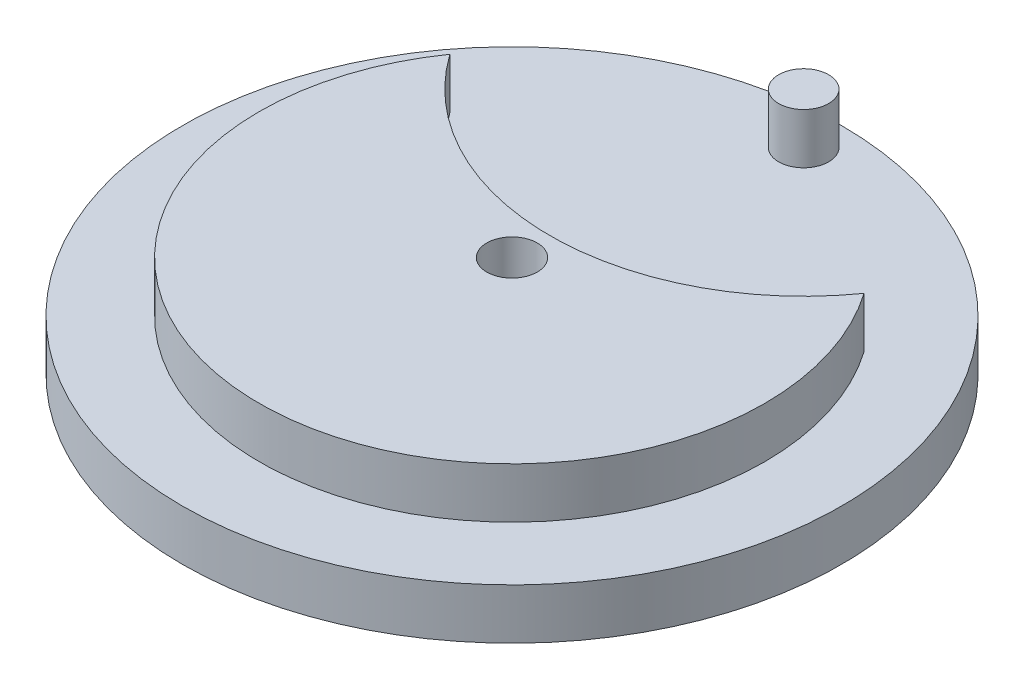
ISO-10303-21;
HEADER;
FILE_DESCRIPTION(('STEP AP214'),'2;1');
FILE_NAME('part.step','',(''),(''),'','','');
FILE_SCHEMA(('AUTOMOTIVE_DESIGN { 1 0 10303 214 1 1 1 1 }'));
ENDSEC;
DATA;
#1=APPLICATION_CONTEXT('core data for automotive mechanical design processes');
#2=APPLICATION_PROTOCOL_DEFINITION('international standard','automotive_design',2000,#1);
#3=PRODUCT_CONTEXT('',#1,'mechanical');
#4=PRODUCT('Part','Part','',(#3));
#5=PRODUCT_RELATED_PRODUCT_CATEGORY('part','',(#4));
#6=PRODUCT_DEFINITION_FORMATION('','',#4);
#7=PRODUCT_DEFINITION_CONTEXT('part definition',#1,'design');
#8=PRODUCT_DEFINITION('design','',#6,#7);
#9=PRODUCT_DEFINITION_SHAPE('','',#8);
#10=(LENGTH_UNIT() NAMED_UNIT(*) SI_UNIT(.MILLI.,.METRE.));
#11=(NAMED_UNIT(*) PLANE_ANGLE_UNIT() SI_UNIT($,.RADIAN.));
#12=(NAMED_UNIT(*) SI_UNIT($,.STERADIAN.) SOLID_ANGLE_UNIT());
#13=UNCERTAINTY_MEASURE_WITH_UNIT(LENGTH_MEASURE(1.E-05),#10,'distance_accuracy_value','');
#14=(GEOMETRIC_REPRESENTATION_CONTEXT(3) GLOBAL_UNCERTAINTY_ASSIGNED_CONTEXT((#13)) GLOBAL_UNIT_ASSIGNED_CONTEXT((#10,
#11,#12)) REPRESENTATION_CONTEXT('',''));
#15=CARTESIAN_POINT('',(0.,0.,0.));
#16=DIRECTION('',(0.,0.,1.));
#17=DIRECTION('',(1.,0.,0.));
#18=AXIS2_PLACEMENT_3D('',#15,#16,#17);
#19=CARTESIAN_POINT('',(0.,10.,0.));
#20=DIRECTION('',(0.,-1.,0.));
#21=DIRECTION('',(0.,0.,-1.));
#22=AXIS2_PLACEMENT_3D('',#19,#20,#21);
#23=CYLINDRICAL_SURFACE('',#22,65.2350269189626);
#24=CARTESIAN_POINT('',(0.,10.,0.));
#25=DIRECTION('',(0.,1.,0.));
#26=DIRECTION('',(0.,0.,1.));
#27=AXIS2_PLACEMENT_3D('',#24,#25,#26);
#28=CIRCLE('',#27,65.2350269189626);
#29=CARTESIAN_POINT('',(0.,10.,65.2350269189626));
#30=VERTEX_POINT('',#29);
#31=EDGE_CURVE('E87',#30,#30,#28,.T.);
#32=ORIENTED_EDGE('',*,*,#31,.F.);
#33=EDGE_LOOP('',(#32));
#34=FACE_BOUND('',#33,.T.);
#35=CARTESIAN_POINT('',(0.,0.,0.));
#36=DIRECTION('',(0.,1.,0.));
#37=DIRECTION('',(0.,0.,1.));
#38=AXIS2_PLACEMENT_3D('',#35,#36,#37);
#39=CIRCLE('',#38,65.2350269189626);
#40=CARTESIAN_POINT('',(0.,0.,65.2350269189626));
#41=VERTEX_POINT('',#40);
#42=EDGE_CURVE('E38',#41,#41,#39,.T.);
#43=ORIENTED_EDGE('',*,*,#42,.T.);
#44=EDGE_LOOP('',(#43));
#45=FACE_BOUND('',#44,.T.);
#46=ADVANCED_FACE('F35',(#34,#45),#23,.T.);
#47=CARTESIAN_POINT('',(0.,10.,0.));
#48=DIRECTION('',(0.,1.,0.));
#49=DIRECTION('',(0.,0.,1.));
#50=AXIS2_PLACEMENT_3D('',#47,#48,#49);
#51=PLANE('',#50);
#52=CARTESIAN_POINT('',(0.,10.,-57.7350269189626));
#53=DIRECTION('',(0.,1.,0.));
#54=DIRECTION('',(0.,0.,1.));
#55=AXIS2_PLACEMENT_3D('',#52,#53,#54);
#56=CIRCLE('',#55,4.95);
#57=CARTESIAN_POINT('',(0.,10.,-52.7850269189626));
#58=VERTEX_POINT('',#57);
#59=EDGE_CURVE('E84',#58,#58,#56,.T.);
#60=ORIENTED_EDGE('',*,*,#59,.F.);
#61=EDGE_LOOP('',(#60));
#62=FACE_BOUND('',#61,.T.);
#63=ORIENTED_EDGE('',*,*,#31,.T.);
#64=EDGE_LOOP('',(#63));
#65=FACE_BOUND('',#64,.T.);
#66=CARTESIAN_POINT('',(0.,10.,0.));
#67=DIRECTION('',(0.,1.,0.));
#68=DIRECTION('',(0.,0.,1.));
#69=AXIS2_PLACEMENT_3D('',#66,#67,#68);
#70=CIRCLE('',#69,50.0338358093371);
#71=CARTESIAN_POINT('',(-40.9891140728577,10.,-28.6928083902215));
#72=VERTEX_POINT('',#71);
#73=CARTESIAN_POINT('',(40.9891140728577,10.,-28.6928083902214));
#74=VERTEX_POINT('',#73);
#75=EDGE_CURVE('E43',#72,#74,#70,.T.);
#76=ORIENTED_EDGE('',*,*,#75,.F.);
#77=CARTESIAN_POINT('',(0.,10.,-57.7350269189626));
#78=DIRECTION('',(0.,1.,0.));
#79=DIRECTION('',(0.,0.,1.));
#80=AXIS2_PLACEMENT_3D('',#77,#78,#79);
#81=CIRCLE('',#80,50.2350269189626);
#82=EDGE_CURVE('E11',#72,#74,#81,.T.);
#83=ORIENTED_EDGE('',*,*,#82,.T.);
#84=EDGE_LOOP('',(#76,#83));
#85=FACE_BOUND('',#84,.T.);
#86=ADVANCED_FACE('F92',(#62,#65,#85),#51,.T.);
#87=CARTESIAN_POINT('',(0.,0.,0.));
#88=DIRECTION('',(0.,1.,0.));
#89=DIRECTION('',(0.,0.,1.));
#90=AXIS2_PLACEMENT_3D('',#87,#88,#89);
#91=PLANE('',#90);
#92=ORIENTED_EDGE('',*,*,#42,.F.);
#93=EDGE_LOOP('',(#92));
#94=FACE_BOUND('',#93,.T.);
#95=CARTESIAN_POINT('',(0.,0.,0.));
#96=DIRECTION('',(0.,1.,0.));
#97=DIRECTION('',(0.,0.,1.));
#98=AXIS2_PLACEMENT_3D('',#95,#96,#97);
#99=CIRCLE('',#98,5.);
#100=CARTESIAN_POINT('',(0.,0.,5.));
#101=VERTEX_POINT('',#100);
#102=EDGE_CURVE('E76',#101,#101,#99,.T.);
#103=ORIENTED_EDGE('',*,*,#102,.T.);
#104=EDGE_LOOP('',(#103));
#105=FACE_BOUND('',#104,.T.);
#106=ADVANCED_FACE('F99',(#94,#105),#91,.F.);
#107=CARTESIAN_POINT('',(0.,20.,-57.7350269189626));
#108=DIRECTION('',(0.,-1.,0.));
#109=DIRECTION('',(0.,0.,-1.));
#110=AXIS2_PLACEMENT_3D('',#107,#108,#109);
#111=CYLINDRICAL_SURFACE('',#110,50.2350269189626);
#112=DIRECTION('',(0.,-1.,0.));
#113=VECTOR('',#112,1.);
#114=CARTESIAN_POINT('',(40.9891140728577,20.,-28.6928083902214));
#115=LINE('',#114,#113);
#116=CARTESIAN_POINT('',(40.9891140728577,20.,-28.6928083902214));
#117=VERTEX_POINT('',#116);
#118=EDGE_CURVE('E65',#117,#74,#115,.T.);
#119=ORIENTED_EDGE('',*,*,#118,.T.);
#120=ORIENTED_EDGE('',*,*,#82,.F.);
#121=DIRECTION('',(0.,-1.,0.));
#122=VECTOR('',#121,1.);
#123=CARTESIAN_POINT('',(-40.9891140728577,20.,-28.6928083902215));
#124=LINE('',#123,#122);
#125=CARTESIAN_POINT('',(-40.9891140728577,20.,-28.6928083902215));
#126=VERTEX_POINT('',#125);
#127=EDGE_CURVE('E58',#126,#72,#124,.T.);
#128=ORIENTED_EDGE('',*,*,#127,.F.);
#129=CARTESIAN_POINT('',(0.,20.,-57.7350269189626));
#130=DIRECTION('',(0.,1.,0.));
#131=DIRECTION('',(0.,0.,1.));
#132=AXIS2_PLACEMENT_3D('',#129,#130,#131);
#133=CIRCLE('',#132,50.2350269189626);
#134=EDGE_CURVE('E63',#126,#117,#133,.T.);
#135=ORIENTED_EDGE('',*,*,#134,.T.);
#136=EDGE_LOOP('',(#119,#120,#128,#135));
#137=FACE_BOUND('',#136,.T.);
#138=ADVANCED_FACE('F61',(#137),#111,.F.);
#139=CARTESIAN_POINT('',(0.,20.,0.));
#140=DIRECTION('',(0.,-1.,0.));
#141=DIRECTION('',(0.,0.,-1.));
#142=AXIS2_PLACEMENT_3D('',#139,#140,#141);
#143=CYLINDRICAL_SURFACE('',#142,5.);
#144=CARTESIAN_POINT('',(0.,20.,0.));
#145=DIRECTION('',(0.,1.,0.));
#146=DIRECTION('',(0.,0.,1.));
#147=AXIS2_PLACEMENT_3D('',#144,#145,#146);
#148=CIRCLE('',#147,5.);
#149=CARTESIAN_POINT('',(0.,20.,5.));
#150=VERTEX_POINT('',#149);
#151=EDGE_CURVE('E73',#150,#150,#148,.T.);
#152=ORIENTED_EDGE('',*,*,#151,.T.);
#153=EDGE_LOOP('',(#152));
#154=FACE_BOUND('',#153,.T.);
#155=ORIENTED_EDGE('',*,*,#102,.F.);
#156=EDGE_LOOP('',(#155));
#157=FACE_BOUND('',#156,.T.);
#158=ADVANCED_FACE('F104',(#154,#157),#143,.F.);
#159=CARTESIAN_POINT('',(0.,20.,0.));
#160=DIRECTION('',(0.,-1.,0.));
#161=DIRECTION('',(0.,0.,-1.));
#162=AXIS2_PLACEMENT_3D('',#159,#160,#161);
#163=CYLINDRICAL_SURFACE('',#162,50.0338358093371);
#164=ORIENTED_EDGE('',*,*,#75,.T.);
#165=ORIENTED_EDGE('',*,*,#118,.F.);
#166=CARTESIAN_POINT('',(0.,20.,0.));
#167=DIRECTION('',(0.,1.,0.));
#168=DIRECTION('',(0.,0.,1.));
#169=AXIS2_PLACEMENT_3D('',#166,#167,#168);
#170=CIRCLE('',#169,50.0338358093371);
#171=EDGE_CURVE('E68',#126,#117,#170,.T.);
#172=ORIENTED_EDGE('',*,*,#171,.F.);
#173=ORIENTED_EDGE('',*,*,#127,.T.);
#174=EDGE_LOOP('',(#164,#165,#172,#173));
#175=FACE_BOUND('',#174,.T.);
#176=ADVANCED_FACE('F69',(#175),#163,.T.);
#177=CARTESIAN_POINT('',(0.,20.,0.));
#178=DIRECTION('',(0.,1.,0.));
#179=DIRECTION('',(0.,0.,1.));
#180=AXIS2_PLACEMENT_3D('',#177,#178,#179);
#181=PLANE('',#180);
#182=ORIENTED_EDGE('',*,*,#151,.F.);
#183=EDGE_LOOP('',(#182));
#184=FACE_BOUND('',#183,.T.);
#185=ORIENTED_EDGE('',*,*,#134,.F.);
#186=ORIENTED_EDGE('',*,*,#171,.T.);
#187=EDGE_LOOP('',(#185,#186));
#188=FACE_BOUND('',#187,.T.);
#189=ADVANCED_FACE('F72',(#184,#188),#181,.T.);
#190=CARTESIAN_POINT('',(0.,20.,-57.7350269189626));
#191=DIRECTION('',(0.,-1.,0.));
#192=DIRECTION('',(0.,0.,-1.));
#193=AXIS2_PLACEMENT_3D('',#190,#191,#192);
#194=CYLINDRICAL_SURFACE('',#193,4.95);
#195=ORIENTED_EDGE('',*,*,#59,.T.);
#196=EDGE_LOOP('',(#195));
#197=FACE_BOUND('',#196,.T.);
#198=CARTESIAN_POINT('',(0.,20.,-57.7350269189626));
#199=DIRECTION('',(0.,1.,0.));
#200=DIRECTION('',(0.,0.,1.));
#201=AXIS2_PLACEMENT_3D('',#198,#199,#200);
#202=CIRCLE('',#201,4.95);
#203=CARTESIAN_POINT('',(0.,20.,-52.7850269189626));
#204=VERTEX_POINT('',#203);
#205=EDGE_CURVE('E82',#204,#204,#202,.T.);
#206=ORIENTED_EDGE('',*,*,#205,.F.);
#207=EDGE_LOOP('',(#206));
#208=FACE_BOUND('',#207,.T.);
#209=ADVANCED_FACE('F121',(#197,#208),#194,.T.);
#210=CARTESIAN_POINT('',(0.,20.,0.));
#211=DIRECTION('',(0.,1.,0.));
#212=DIRECTION('',(0.,0.,1.));
#213=AXIS2_PLACEMENT_3D('',#210,#211,#212);
#214=PLANE('',#213);
#215=ORIENTED_EDGE('',*,*,#205,.T.);
#216=EDGE_LOOP('',(#215));
#217=FACE_BOUND('',#216,.T.);
#218=ADVANCED_FACE('F124',(#217),#214,.T.);
#219=CLOSED_SHELL('',(#46,#86,#106,#138,#158,#176,#189,#209,#218));
#220=MANIFOLD_SOLID_BREP('B2',#219);
#221=ADVANCED_BREP_SHAPE_REPRESENTATION('',(#18,#220),#14);
#222=SHAPE_DEFINITION_REPRESENTATION(#9,#221);
ENDSEC;
END-ISO-10303-21;
